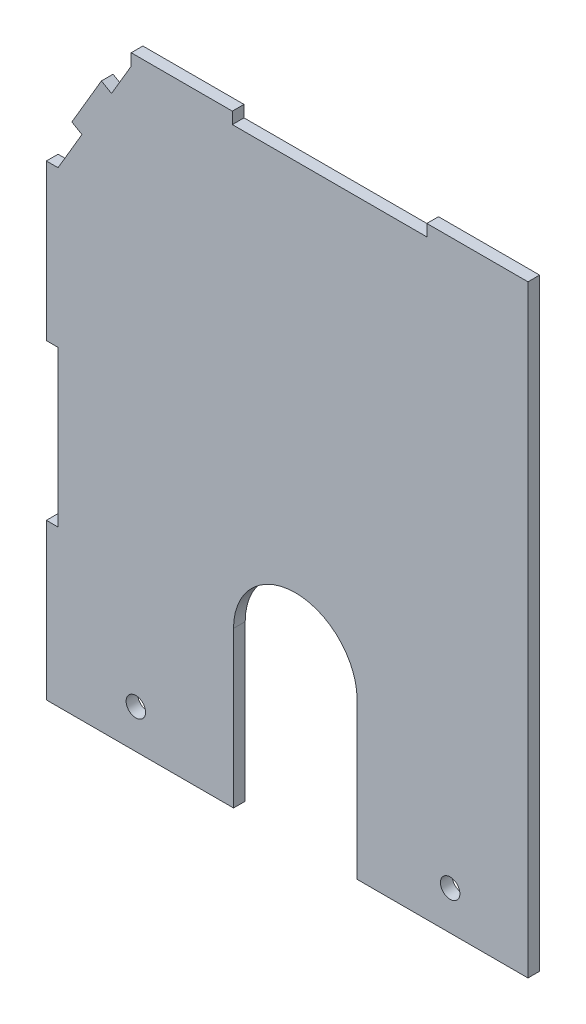
ISO-10303-21;
HEADER;
FILE_DESCRIPTION(('STEP AP214'),'2;1');
FILE_NAME('part.step','',(''),(''),'','','');
FILE_SCHEMA(('AUTOMOTIVE_DESIGN { 1 0 10303 214 1 1 1 1 }'));
ENDSEC;
DATA;
#1=APPLICATION_CONTEXT('core data for automotive mechanical design processes');
#2=APPLICATION_PROTOCOL_DEFINITION('international standard','automotive_design',2000,#1);
#3=PRODUCT_CONTEXT('',#1,'mechanical');
#4=PRODUCT('Part','Part','',(#3));
#5=PRODUCT_RELATED_PRODUCT_CATEGORY('part','',(#4));
#6=PRODUCT_DEFINITION_FORMATION('','',#4);
#7=PRODUCT_DEFINITION_CONTEXT('part definition',#1,'design');
#8=PRODUCT_DEFINITION('design','',#6,#7);
#9=PRODUCT_DEFINITION_SHAPE('','',#8);
#10=(LENGTH_UNIT() NAMED_UNIT(*) SI_UNIT(.MILLI.,.METRE.));
#11=(NAMED_UNIT(*) PLANE_ANGLE_UNIT() SI_UNIT($,.RADIAN.));
#12=(NAMED_UNIT(*) SI_UNIT($,.STERADIAN.) SOLID_ANGLE_UNIT());
#13=UNCERTAINTY_MEASURE_WITH_UNIT(LENGTH_MEASURE(1.E-05),#10,'distance_accuracy_value','');
#14=(GEOMETRIC_REPRESENTATION_CONTEXT(3) GLOBAL_UNCERTAINTY_ASSIGNED_CONTEXT((#13)) GLOBAL_UNIT_ASSIGNED_CONTEXT((#10,
#11,#12)) REPRESENTATION_CONTEXT('',''));
#15=CARTESIAN_POINT('',(0.,0.,0.));
#16=DIRECTION('',(0.,0.,1.));
#17=DIRECTION('',(1.,0.,0.));
#18=AXIS2_PLACEMENT_3D('',#15,#16,#17);
#19=CARTESIAN_POINT('',(0.56000000000009,-36.0440360897276,3.));
#20=DIRECTION('',(0.,0.,1.));
#21=DIRECTION('',(1.,0.,0.));
#22=AXIS2_PLACEMENT_3D('',#19,#20,#21);
#23=PLANE('',#22);
#24=CARTESIAN_POINT('',(-40.4399999999999,-66.0440360897276,3.));
#25=DIRECTION('',(0.,0.,1.));
#26=DIRECTION('',(1.,0.,0.));
#27=AXIS2_PLACEMENT_3D('',#24,#25,#26);
#28=CIRCLE('',#27,2.5);
#29=CARTESIAN_POINT('',(-37.9399999999999,-66.0440360897276,3.));
#30=VERTEX_POINT('',#29);
#31=EDGE_CURVE('E226',#30,#30,#28,.T.);
#32=ORIENTED_EDGE('',*,*,#31,.F.);
#33=EDGE_LOOP('',(#32));
#34=FACE_BOUND('',#33,.T.);
#35=DIRECTION('',(1.,0.,0.));
#36=VECTOR('',#35,1.);
#37=CARTESIAN_POINT('',(-60.4399999999999,-76.0440360897276,3.));
#38=LINE('',#37,#36);
#39=CARTESIAN_POINT('',(-63.4399999999999,-76.0440360897276,3.));
#40=VERTEX_POINT('',#39);
#41=CARTESIAN_POINT('',(-15.3243473367714,-76.0440360897276,3.));
#42=VERTEX_POINT('',#41);
#43=EDGE_CURVE('E141',#40,#42,#38,.T.);
#44=ORIENTED_EDGE('',*,*,#43,.T.);
#45=DIRECTION('',(0.,1.,0.));
#46=VECTOR('',#45,1.);
#47=CARTESIAN_POINT('',(-15.3243473367714,-36.0440360897276,3.));
#48=LINE('',#47,#46);
#49=CARTESIAN_POINT('',(-15.3243473367714,-36.0440360897276,3.));
#50=VERTEX_POINT('',#49);
#51=EDGE_CURVE('E392',#42,#50,#48,.T.);
#52=ORIENTED_EDGE('',*,*,#51,.T.);
#53=CARTESIAN_POINT('',(0.56000000000009,-36.0440360897276,3.));
#54=DIRECTION('',(0.,0.,-1.));
#55=DIRECTION('',(1.,0.,0.));
#56=AXIS2_PLACEMENT_3D('',#53,#54,#55);
#57=CIRCLE('',#56,15.8843473367715);
#58=CARTESIAN_POINT('',(16.4443473367716,-36.0440360897276,3.));
#59=VERTEX_POINT('',#58);
#60=EDGE_CURVE('E330',#50,#59,#57,.T.);
#61=ORIENTED_EDGE('',*,*,#60,.T.);
#62=DIRECTION('',(0.,-1.,0.));
#63=VECTOR('',#62,1.);
#64=CARTESIAN_POINT('',(16.4443473367716,-36.0440360897276,3.));
#65=LINE('',#64,#63);
#66=CARTESIAN_POINT('',(16.4443473367716,-76.0440360897275,3.));
#67=VERTEX_POINT('',#66);
#68=EDGE_CURVE('E348',#59,#67,#65,.T.);
#69=ORIENTED_EDGE('',*,*,#68,.T.);
#70=DIRECTION('',(1.,0.,0.));
#71=VECTOR('',#70,1.);
#72=CARTESIAN_POINT('',(60.3700000000001,-76.0440360897275,3.));
#73=LINE('',#72,#71);
#74=CARTESIAN_POINT('',(60.3700000000001,-76.0440360897275,3.));
#75=VERTEX_POINT('',#74);
#76=EDGE_CURVE('E345',#67,#75,#73,.T.);
#77=ORIENTED_EDGE('',*,*,#76,.T.);
#78=DIRECTION('',(0.,1.,0.));
#79=VECTOR('',#78,1.);
#80=CARTESIAN_POINT('',(60.3700000000001,75.9559639102725,3.));
#81=LINE('',#80,#79);
#82=CARTESIAN_POINT('',(60.3700000000001,78.9559639102725,3.));
#83=VERTEX_POINT('',#82);
#84=EDGE_CURVE('E347',#75,#83,#81,.T.);
#85=ORIENTED_EDGE('',*,*,#84,.T.);
#86=DIRECTION('',(-1.,0.,0.));
#87=VECTOR('',#86,1.);
#88=CARTESIAN_POINT('',(60.3700000000001,78.9559639102725,3.));
#89=LINE('',#88,#87);
#90=CARTESIAN_POINT('',(34.3700000000001,78.9559639102725,3.));
#91=VERTEX_POINT('',#90);
#92=EDGE_CURVE('E350',#83,#91,#89,.T.);
#93=ORIENTED_EDGE('',*,*,#92,.T.);
#94=DIRECTION('',(0.,-1.,0.));
#95=VECTOR('',#94,1.);
#96=CARTESIAN_POINT('',(34.3700000000001,78.9559639102725,3.));
#97=LINE('',#96,#95);
#98=CARTESIAN_POINT('',(34.3700000000001,75.9559639102724,3.));
#99=VERTEX_POINT('',#98);
#100=EDGE_CURVE('E356',#91,#99,#97,.T.);
#101=ORIENTED_EDGE('',*,*,#100,.T.);
#102=DIRECTION('',(-1.,0.,0.));
#103=VECTOR('',#102,1.);
#104=CARTESIAN_POINT('',(34.3700000000001,75.9559639102724,3.));
#105=LINE('',#104,#103);
#106=CARTESIAN_POINT('',(-15.6299999999999,75.9559639102725,3.));
#107=VERTEX_POINT('',#106);
#108=EDGE_CURVE('E358',#99,#107,#105,.T.);
#109=ORIENTED_EDGE('',*,*,#108,.T.);
#110=DIRECTION('',(0.,1.,0.));
#111=VECTOR('',#110,1.);
#112=CARTESIAN_POINT('',(-15.6299999999999,78.9559639102725,3.));
#113=LINE('',#112,#111);
#114=CARTESIAN_POINT('',(-15.6299999999999,78.9559639102725,3.));
#115=VERTEX_POINT('',#114);
#116=EDGE_CURVE('E360',#107,#115,#113,.T.);
#117=ORIENTED_EDGE('',*,*,#116,.T.);
#118=DIRECTION('',(-1.,0.,0.));
#119=VECTOR('',#118,1.);
#120=CARTESIAN_POINT('',(-41.6299999999999,78.9559639102725,3.));
#121=LINE('',#120,#119);
#122=CARTESIAN_POINT('',(-41.6299999999999,78.9559639102725,3.));
#123=VERTEX_POINT('',#122);
#124=EDGE_CURVE('E362',#115,#123,#121,.T.);
#125=ORIENTED_EDGE('',*,*,#124,.T.);
#126=DIRECTION('',(0.,-1.,0.));
#127=VECTOR('',#126,1.);
#128=CARTESIAN_POINT('',(-41.6299999999999,75.9559639102724,3.));
#129=LINE('',#128,#127);
#130=CARTESIAN_POINT('',(-41.6299999999999,75.9559639102724,3.));
#131=VERTEX_POINT('',#130);
#132=EDGE_CURVE('E364',#123,#131,#129,.T.);
#133=ORIENTED_EDGE('',*,*,#132,.T.);
#134=DIRECTION('',(-0.506749312224092,-0.862093460455657,0.));
#135=VECTOR('',#134,1.);
#136=CARTESIAN_POINT('',(-41.6299999999999,75.9559639102724,3.));
#137=LINE('',#136,#135);
#138=CARTESIAN_POINT('',(-46.6974931222408,67.3350293057159,3.));
#139=VERTEX_POINT('',#138);
#140=EDGE_CURVE('E366',#131,#139,#137,.T.);
#141=ORIENTED_EDGE('',*,*,#140,.T.);
#142=DIRECTION('',(-0.862093460455656,0.506749312224094,0.));
#143=VECTOR('',#142,1.);
#144=CARTESIAN_POINT('',(-46.6974931222408,67.3350293057159,3.));
#145=LINE('',#144,#143);
#146=CARTESIAN_POINT('',(-49.2837735036078,68.8552772423882,3.));
#147=VERTEX_POINT('',#146);
#148=EDGE_CURVE('E368',#139,#147,#145,.T.);
#149=ORIENTED_EDGE('',*,*,#148,.T.);
#150=DIRECTION('',(-0.506749312224091,-0.862093460455658,0.));
#151=VECTOR('',#150,1.);
#152=CARTESIAN_POINT('',(-56.8850131869692,55.9238753355533,3.));
#153=LINE('',#152,#151);
#154=CARTESIAN_POINT('',(-56.8850131869692,55.9238753355533,3.));
#155=VERTEX_POINT('',#154);
#156=EDGE_CURVE('E370',#147,#155,#153,.T.);
#157=ORIENTED_EDGE('',*,*,#156,.T.);
#158=DIRECTION('',(0.862093460455658,-0.50674931222409,0.));
#159=VECTOR('',#158,1.);
#160=CARTESIAN_POINT('',(-54.2987328056022,54.403627398881,3.));
#161=LINE('',#160,#159);
#162=CARTESIAN_POINT('',(-54.2987328056022,54.403627398881,3.));
#163=VERTEX_POINT('',#162);
#164=EDGE_CURVE('E372',#155,#163,#161,.T.);
#165=ORIENTED_EDGE('',*,*,#164,.T.);
#166=DIRECTION('',(-0.506749312224092,-0.862093460455657,0.));
#167=VECTOR('',#166,1.);
#168=CARTESIAN_POINT('',(-54.2987328056022,54.403627398881,3.));
#169=LINE('',#168,#167);
#170=CARTESIAN_POINT('',(-60.4399999999999,43.9559639102724,3.));
#171=VERTEX_POINT('',#170);
#172=EDGE_CURVE('E374',#163,#171,#169,.T.);
#173=ORIENTED_EDGE('',*,*,#172,.T.);
#174=DIRECTION('',(-1.,0.,0.));
#175=VECTOR('',#174,1.);
#176=CARTESIAN_POINT('',(-60.4399999999999,43.9559639102724,3.));
#177=LINE('',#176,#175);
#178=CARTESIAN_POINT('',(-63.4399999999999,43.9559639102724,3.));
#179=VERTEX_POINT('',#178);
#180=EDGE_CURVE('E376',#171,#179,#177,.T.);
#181=ORIENTED_EDGE('',*,*,#180,.T.);
#182=DIRECTION('',(0.,-1.,0.));
#183=VECTOR('',#182,1.);
#184=CARTESIAN_POINT('',(-63.4399999999999,43.9559639102724,3.));
#185=LINE('',#184,#183);
#186=CARTESIAN_POINT('',(-63.4399999999999,3.95596391027241,3.));
#187=VERTEX_POINT('',#186);
#188=EDGE_CURVE('E378',#179,#187,#185,.T.);
#189=ORIENTED_EDGE('',*,*,#188,.T.);
#190=DIRECTION('',(1.,0.,0.));
#191=VECTOR('',#190,1.);
#192=CARTESIAN_POINT('',(-63.4399999999999,3.95596391027241,3.));
#193=LINE('',#192,#191);
#194=CARTESIAN_POINT('',(-60.4399999999999,3.95596391027241,3.));
#195=VERTEX_POINT('',#194);
#196=EDGE_CURVE('E206',#187,#195,#193,.T.);
#197=ORIENTED_EDGE('',*,*,#196,.T.);
#198=DIRECTION('',(0.,-1.,0.));
#199=VECTOR('',#198,1.);
#200=CARTESIAN_POINT('',(-60.4399999999999,3.95596391027241,3.));
#201=LINE('',#200,#199);
#202=CARTESIAN_POINT('',(-60.4399999999999,-36.0440360897276,3.));
#203=VERTEX_POINT('',#202);
#204=EDGE_CURVE('E200',#195,#203,#201,.T.);
#205=ORIENTED_EDGE('',*,*,#204,.T.);
#206=DIRECTION('',(-1.,0.,0.));
#207=VECTOR('',#206,1.);
#208=CARTESIAN_POINT('',(-63.4399999999999,-36.0440360897276,3.));
#209=LINE('',#208,#207);
#210=CARTESIAN_POINT('',(-63.4399999999999,-36.0440360897276,3.));
#211=VERTEX_POINT('',#210);
#212=EDGE_CURVE('E204',#203,#211,#209,.T.);
#213=ORIENTED_EDGE('',*,*,#212,.T.);
#214=DIRECTION('',(0.,-1.,0.));
#215=VECTOR('',#214,1.);
#216=CARTESIAN_POINT('',(-63.4399999999999,-76.0440360897276,3.));
#217=LINE('',#216,#215);
#218=EDGE_CURVE('E54',#211,#40,#217,.T.);
#219=ORIENTED_EDGE('',*,*,#218,.T.);
#220=EDGE_LOOP('',(#44,#52,#61,#69,#77,#85,#93,#101,#109,#117,#125,#133,#141,#149,#157,#165,
#173,#181,#189,#197,#205,#213,#219));
#221=FACE_BOUND('',#220,.T.);
#222=CARTESIAN_POINT('',(40.3700000000001,-66.0440360897276,3.));
#223=DIRECTION('',(0.,0.,1.));
#224=DIRECTION('',(1.,0.,0.));
#225=AXIS2_PLACEMENT_3D('',#222,#223,#224);
#226=CIRCLE('',#225,2.5);
#227=CARTESIAN_POINT('',(42.8700000000001,-66.0440360897276,3.));
#228=VERTEX_POINT('',#227);
#229=EDGE_CURVE('E660',#228,#228,#226,.T.);
#230=ORIENTED_EDGE('',*,*,#229,.F.);
#231=EDGE_LOOP('',(#230));
#232=FACE_BOUND('',#231,.T.);
#233=ADVANCED_FACE('F37',(#34,#221,#232),#23,.T.);
#234=CARTESIAN_POINT('',(0.56000000000009,-36.0440360897276,0.));
#235=DIRECTION('',(0.,0.,1.));
#236=DIRECTION('',(1.,0.,0.));
#237=AXIS2_PLACEMENT_3D('',#234,#235,#236);
#238=PLANE('',#237);
#239=DIRECTION('',(1.,0.,0.));
#240=VECTOR('',#239,1.);
#241=CARTESIAN_POINT('',(-15.3243473367714,-76.0440360897276,0.));
#242=LINE('',#241,#240);
#243=CARTESIAN_POINT('',(-63.4399999999999,-76.0440360897276,0.));
#244=VERTEX_POINT('',#243);
#245=CARTESIAN_POINT('',(-15.3243473367714,-76.0440360897276,0.));
#246=VERTEX_POINT('',#245);
#247=EDGE_CURVE('E135',#244,#246,#242,.T.);
#248=ORIENTED_EDGE('',*,*,#247,.F.);
#249=DIRECTION('',(0.,-1.,0.));
#250=VECTOR('',#249,1.);
#251=CARTESIAN_POINT('',(-63.4399999999999,-76.0440360897276,0.));
#252=LINE('',#251,#250);
#253=CARTESIAN_POINT('',(-63.4399999999999,-36.0440360897276,0.));
#254=VERTEX_POINT('',#253);
#255=EDGE_CURVE('E267',#254,#244,#252,.T.);
#256=ORIENTED_EDGE('',*,*,#255,.F.);
#257=DIRECTION('',(-1.,0.,0.));
#258=VECTOR('',#257,1.);
#259=CARTESIAN_POINT('',(-63.4399999999999,-36.0440360897276,0.));
#260=LINE('',#259,#258);
#261=CARTESIAN_POINT('',(-60.4399999999999,-36.0440360897276,0.));
#262=VERTEX_POINT('',#261);
#263=EDGE_CURVE('E128',#262,#254,#260,.T.);
#264=ORIENTED_EDGE('',*,*,#263,.F.);
#265=DIRECTION('',(0.,-1.,0.));
#266=VECTOR('',#265,1.);
#267=CARTESIAN_POINT('',(-60.4399999999999,3.95596391027241,0.));
#268=LINE('',#267,#266);
#269=CARTESIAN_POINT('',(-60.4399999999999,3.95596391027241,0.));
#270=VERTEX_POINT('',#269);
#271=EDGE_CURVE('E214',#270,#262,#268,.T.);
#272=ORIENTED_EDGE('',*,*,#271,.F.);
#273=DIRECTION('',(1.,0.,0.));
#274=VECTOR('',#273,1.);
#275=CARTESIAN_POINT('',(-63.4399999999999,3.95596391027241,0.));
#276=LINE('',#275,#274);
#277=CARTESIAN_POINT('',(-63.4399999999999,3.95596391027241,0.));
#278=VERTEX_POINT('',#277);
#279=EDGE_CURVE('E263',#278,#270,#276,.T.);
#280=ORIENTED_EDGE('',*,*,#279,.F.);
#281=DIRECTION('',(0.,-1.,0.));
#282=VECTOR('',#281,1.);
#283=CARTESIAN_POINT('',(-63.4399999999999,43.9559639102724,0.));
#284=LINE('',#283,#282);
#285=CARTESIAN_POINT('',(-63.4399999999999,43.9559639102724,0.));
#286=VERTEX_POINT('',#285);
#287=EDGE_CURVE('E261',#286,#278,#284,.T.);
#288=ORIENTED_EDGE('',*,*,#287,.F.);
#289=DIRECTION('',(-1.,0.,0.));
#290=VECTOR('',#289,1.);
#291=CARTESIAN_POINT('',(-60.4399999999999,43.9559639102724,0.));
#292=LINE('',#291,#290);
#293=CARTESIAN_POINT('',(-60.4399999999999,43.9559639102724,0.));
#294=VERTEX_POINT('',#293);
#295=EDGE_CURVE('E259',#294,#286,#292,.T.);
#296=ORIENTED_EDGE('',*,*,#295,.F.);
#297=DIRECTION('',(-0.506749312224092,-0.862093460455657,0.));
#298=VECTOR('',#297,1.);
#299=CARTESIAN_POINT('',(-54.2987328056022,54.403627398881,0.));
#300=LINE('',#299,#298);
#301=CARTESIAN_POINT('',(-54.2987328056022,54.403627398881,0.));
#302=VERTEX_POINT('',#301);
#303=EDGE_CURVE('E257',#302,#294,#300,.T.);
#304=ORIENTED_EDGE('',*,*,#303,.F.);
#305=DIRECTION('',(0.862093460455658,-0.50674931222409,0.));
#306=VECTOR('',#305,1.);
#307=CARTESIAN_POINT('',(-54.2987328056022,54.403627398881,0.));
#308=LINE('',#307,#306);
#309=CARTESIAN_POINT('',(-56.8850131869692,55.9238753355533,0.));
#310=VERTEX_POINT('',#309);
#311=EDGE_CURVE('E255',#310,#302,#308,.T.);
#312=ORIENTED_EDGE('',*,*,#311,.F.);
#313=DIRECTION('',(-0.506749312224091,-0.862093460455658,0.));
#314=VECTOR('',#313,1.);
#315=CARTESIAN_POINT('',(-56.8850131869692,55.9238753355533,0.));
#316=LINE('',#315,#314);
#317=CARTESIAN_POINT('',(-49.2837735036078,68.8552772423882,0.));
#318=VERTEX_POINT('',#317);
#319=EDGE_CURVE('E253',#318,#310,#316,.T.);
#320=ORIENTED_EDGE('',*,*,#319,.F.);
#321=DIRECTION('',(-0.862093460455656,0.506749312224094,0.));
#322=VECTOR('',#321,1.);
#323=CARTESIAN_POINT('',(-46.6974931222408,67.3350293057159,0.));
#324=LINE('',#323,#322);
#325=CARTESIAN_POINT('',(-46.6974931222408,67.3350293057159,0.));
#326=VERTEX_POINT('',#325);
#327=EDGE_CURVE('E251',#326,#318,#324,.T.);
#328=ORIENTED_EDGE('',*,*,#327,.F.);
#329=DIRECTION('',(-0.506749312224092,-0.862093460455657,0.));
#330=VECTOR('',#329,1.);
#331=CARTESIAN_POINT('',(-41.6299999999999,75.9559639102724,0.));
#332=LINE('',#331,#330);
#333=CARTESIAN_POINT('',(-41.6299999999999,75.9559639102724,0.));
#334=VERTEX_POINT('',#333);
#335=EDGE_CURVE('E249',#334,#326,#332,.T.);
#336=ORIENTED_EDGE('',*,*,#335,.F.);
#337=DIRECTION('',(0.,-1.,0.));
#338=VECTOR('',#337,1.);
#339=CARTESIAN_POINT('',(-41.6299999999999,75.9559639102724,0.));
#340=LINE('',#339,#338);
#341=CARTESIAN_POINT('',(-41.6299999999999,78.9559639102725,0.));
#342=VERTEX_POINT('',#341);
#343=EDGE_CURVE('E247',#342,#334,#340,.T.);
#344=ORIENTED_EDGE('',*,*,#343,.F.);
#345=DIRECTION('',(-1.,0.,0.));
#346=VECTOR('',#345,1.);
#347=CARTESIAN_POINT('',(-41.6299999999999,78.9559639102725,0.));
#348=LINE('',#347,#346);
#349=CARTESIAN_POINT('',(-15.6299999999999,78.9559639102725,0.));
#350=VERTEX_POINT('',#349);
#351=EDGE_CURVE('E245',#350,#342,#348,.T.);
#352=ORIENTED_EDGE('',*,*,#351,.F.);
#353=DIRECTION('',(0.,1.,0.));
#354=VECTOR('',#353,1.);
#355=CARTESIAN_POINT('',(-15.6299999999999,78.9559639102725,0.));
#356=LINE('',#355,#354);
#357=CARTESIAN_POINT('',(-15.6299999999999,75.9559639102725,0.));
#358=VERTEX_POINT('',#357);
#359=EDGE_CURVE('E243',#358,#350,#356,.T.);
#360=ORIENTED_EDGE('',*,*,#359,.F.);
#361=DIRECTION('',(-1.,0.,0.));
#362=VECTOR('',#361,1.);
#363=CARTESIAN_POINT('',(34.3700000000001,75.9559639102724,0.));
#364=LINE('',#363,#362);
#365=CARTESIAN_POINT('',(34.3700000000001,75.9559639102724,0.));
#366=VERTEX_POINT('',#365);
#367=EDGE_CURVE('E241',#366,#358,#364,.T.);
#368=ORIENTED_EDGE('',*,*,#367,.F.);
#369=DIRECTION('',(0.,-1.,0.));
#370=VECTOR('',#369,1.);
#371=CARTESIAN_POINT('',(34.3700000000001,78.9559639102725,0.));
#372=LINE('',#371,#370);
#373=CARTESIAN_POINT('',(34.3700000000001,78.9559639102725,0.));
#374=VERTEX_POINT('',#373);
#375=EDGE_CURVE('E239',#374,#366,#372,.T.);
#376=ORIENTED_EDGE('',*,*,#375,.F.);
#377=DIRECTION('',(-1.,0.,0.));
#378=VECTOR('',#377,1.);
#379=CARTESIAN_POINT('',(60.3700000000001,78.9559639102725,0.));
#380=LINE('',#379,#378);
#381=CARTESIAN_POINT('',(60.3700000000001,78.9559639102725,0.));
#382=VERTEX_POINT('',#381);
#383=EDGE_CURVE('E237',#382,#374,#380,.T.);
#384=ORIENTED_EDGE('',*,*,#383,.F.);
#385=DIRECTION('',(0.,1.,0.));
#386=VECTOR('',#385,1.);
#387=CARTESIAN_POINT('',(60.3700000000001,75.9559639102725,0.));
#388=LINE('',#387,#386);
#389=CARTESIAN_POINT('',(60.3700000000001,-76.0440360897275,0.));
#390=VERTEX_POINT('',#389);
#391=EDGE_CURVE('E235',#390,#382,#388,.T.);
#392=ORIENTED_EDGE('',*,*,#391,.F.);
#393=DIRECTION('',(1.,0.,0.));
#394=VECTOR('',#393,1.);
#395=CARTESIAN_POINT('',(60.3700000000001,-76.0440360897275,0.));
#396=LINE('',#395,#394);
#397=CARTESIAN_POINT('',(16.4443473367716,-76.0440360897275,0.));
#398=VERTEX_POINT('',#397);
#399=EDGE_CURVE('E232',#398,#390,#396,.T.);
#400=ORIENTED_EDGE('',*,*,#399,.F.);
#401=DIRECTION('',(0.,-1.,0.));
#402=VECTOR('',#401,1.);
#403=CARTESIAN_POINT('',(16.4443473367716,-36.0440360897276,0.));
#404=LINE('',#403,#402);
#405=CARTESIAN_POINT('',(16.4443473367716,-36.0440360897276,0.));
#406=VERTEX_POINT('',#405);
#407=EDGE_CURVE('E230',#406,#398,#404,.T.);
#408=ORIENTED_EDGE('',*,*,#407,.F.);
#409=CARTESIAN_POINT('',(0.56000000000009,-36.0440360897276,0.));
#410=DIRECTION('',(0.,0.,-1.));
#411=DIRECTION('',(1.,0.,0.));
#412=AXIS2_PLACEMENT_3D('',#409,#410,#411);
#413=CIRCLE('',#412,15.8843473367715);
#414=CARTESIAN_POINT('',(-15.3243473367714,-36.0440360897276,0.));
#415=VERTEX_POINT('',#414);
#416=EDGE_CURVE('E228',#415,#406,#413,.T.);
#417=ORIENTED_EDGE('',*,*,#416,.F.);
#418=DIRECTION('',(0.,1.,0.));
#419=VECTOR('',#418,1.);
#420=CARTESIAN_POINT('',(-15.3243473367714,-36.0440360897276,0.));
#421=LINE('',#420,#419);
#422=EDGE_CURVE('E225',#246,#415,#421,.T.);
#423=ORIENTED_EDGE('',*,*,#422,.F.);
#424=EDGE_LOOP('',(#248,#256,#264,#272,#280,#288,#296,#304,#312,#320,#328,#336,#344,#352,#360,
#368,#376,#384,#392,#400,#408,#417,#423));
#425=FACE_BOUND('',#424,.T.);
#426=CARTESIAN_POINT('',(-40.4399999999999,-66.0440360897276,0.));
#427=DIRECTION('',(0.,0.,1.));
#428=DIRECTION('',(1.,0.,0.));
#429=AXIS2_PLACEMENT_3D('',#426,#427,#428);
#430=CIRCLE('',#429,2.5);
#431=CARTESIAN_POINT('',(-37.9399999999999,-66.0440360897276,0.));
#432=VERTEX_POINT('',#431);
#433=EDGE_CURVE('E396',#432,#432,#430,.T.);
#434=ORIENTED_EDGE('',*,*,#433,.T.);
#435=EDGE_LOOP('',(#434));
#436=FACE_BOUND('',#435,.T.);
#437=CARTESIAN_POINT('',(40.3700000000001,-66.0440360897276,0.));
#438=DIRECTION('',(0.,0.,1.));
#439=DIRECTION('',(1.,0.,0.));
#440=AXIS2_PLACEMENT_3D('',#437,#438,#439);
#441=CIRCLE('',#440,2.5);
#442=CARTESIAN_POINT('',(42.8700000000001,-66.0440360897276,0.));
#443=VERTEX_POINT('',#442);
#444=EDGE_CURVE('E663',#443,#443,#441,.T.);
#445=ORIENTED_EDGE('',*,*,#444,.T.);
#446=EDGE_LOOP('',(#445));
#447=FACE_BOUND('',#446,.T.);
#448=ADVANCED_FACE('F334',(#425,#436,#447),#238,.F.);
#449=CARTESIAN_POINT('',(-15.3243473367714,-76.0440360897276,3.));
#450=DIRECTION('',(0.,1.,0.));
#451=DIRECTION('',(0.,0.,1.));
#452=AXIS2_PLACEMENT_3D('',#449,#450,#451);
#453=PLANE('',#452);
#454=ORIENTED_EDGE('',*,*,#247,.T.);
#455=DIRECTION('',(0.,0.,-1.));
#456=VECTOR('',#455,1.);
#457=CARTESIAN_POINT('',(-15.3243473367714,-76.0440360897276,3.));
#458=LINE('',#457,#456);
#459=EDGE_CURVE('E11',#42,#246,#458,.T.);
#460=ORIENTED_EDGE('',*,*,#459,.F.);
#461=ORIENTED_EDGE('',*,*,#43,.F.);
#462=DIRECTION('',(0.,0.,-1.));
#463=VECTOR('',#462,1.);
#464=CARTESIAN_POINT('',(-63.4399999999999,-76.0440360897276,3.));
#465=LINE('',#464,#463);
#466=EDGE_CURVE('E220',#40,#244,#465,.T.);
#467=ORIENTED_EDGE('',*,*,#466,.T.);
#468=EDGE_LOOP('',(#454,#460,#461,#467));
#469=FACE_BOUND('',#468,.T.);
#470=ADVANCED_FACE('F39',(#469),#453,.F.);
#471=CARTESIAN_POINT('',(-15.3243473367714,-36.0440360897276,3.));
#472=DIRECTION('',(-1.,0.,0.));
#473=DIRECTION('',(0.,-1.,0.));
#474=AXIS2_PLACEMENT_3D('',#471,#472,#473);
#475=PLANE('',#474);
#476=ORIENTED_EDGE('',*,*,#422,.T.);
#477=DIRECTION('',(0.,0.,-1.));
#478=VECTOR('',#477,1.);
#479=CARTESIAN_POINT('',(-15.3243473367714,-36.0440360897276,3.));
#480=LINE('',#479,#478);
#481=EDGE_CURVE('E46',#50,#415,#480,.T.);
#482=ORIENTED_EDGE('',*,*,#481,.F.);
#483=ORIENTED_EDGE('',*,*,#51,.F.);
#484=ORIENTED_EDGE('',*,*,#459,.T.);
#485=EDGE_LOOP('',(#476,#482,#483,#484));
#486=FACE_BOUND('',#485,.T.);
#487=ADVANCED_FACE('F398',(#486),#475,.F.);
#488=CARTESIAN_POINT('',(0.56000000000009,-36.0440360897276,3.));
#489=DIRECTION('',(0.,0.,-1.));
#490=DIRECTION('',(-1.,0.,0.));
#491=AXIS2_PLACEMENT_3D('',#488,#489,#490);
#492=CYLINDRICAL_SURFACE('',#491,15.8843473367715);
#493=ORIENTED_EDGE('',*,*,#416,.T.);
#494=DIRECTION('',(0.,0.,-1.));
#495=VECTOR('',#494,1.);
#496=CARTESIAN_POINT('',(16.4443473367716,-36.0440360897276,3.));
#497=LINE('',#496,#495);
#498=EDGE_CURVE('E321',#59,#406,#497,.T.);
#499=ORIENTED_EDGE('',*,*,#498,.F.);
#500=ORIENTED_EDGE('',*,*,#60,.F.);
#501=ORIENTED_EDGE('',*,*,#481,.T.);
#502=EDGE_LOOP('',(#493,#499,#500,#501));
#503=FACE_BOUND('',#502,.T.);
#504=ADVANCED_FACE('F328',(#503),#492,.F.);
#505=CARTESIAN_POINT('',(16.4443473367716,-36.0440360897276,3.));
#506=DIRECTION('',(1.,0.,0.));
#507=DIRECTION('',(0.,0.,-1.));
#508=AXIS2_PLACEMENT_3D('',#505,#506,#507);
#509=PLANE('',#508);
#510=ORIENTED_EDGE('',*,*,#407,.T.);
#511=DIRECTION('',(0.,0.,-1.));
#512=VECTOR('',#511,1.);
#513=CARTESIAN_POINT('',(16.4443473367716,-76.0440360897275,3.));
#514=LINE('',#513,#512);
#515=EDGE_CURVE('E318',#67,#398,#514,.T.);
#516=ORIENTED_EDGE('',*,*,#515,.F.);
#517=ORIENTED_EDGE('',*,*,#68,.F.);
#518=ORIENTED_EDGE('',*,*,#498,.T.);
#519=EDGE_LOOP('',(#510,#516,#517,#518));
#520=FACE_BOUND('',#519,.T.);
#521=ADVANCED_FACE('F339',(#520),#509,.F.);
#522=CARTESIAN_POINT('',(60.3700000000001,-76.0440360897275,3.));
#523=DIRECTION('',(0.,1.,0.));
#524=DIRECTION('',(0.,0.,1.));
#525=AXIS2_PLACEMENT_3D('',#522,#523,#524);
#526=PLANE('',#525);
#527=ORIENTED_EDGE('',*,*,#399,.T.);
#528=DIRECTION('',(0.,0.,-1.));
#529=VECTOR('',#528,1.);
#530=CARTESIAN_POINT('',(60.3700000000001,-76.0440360897275,3.));
#531=LINE('',#530,#529);
#532=EDGE_CURVE('E315',#75,#390,#531,.T.);
#533=ORIENTED_EDGE('',*,*,#532,.F.);
#534=ORIENTED_EDGE('',*,*,#76,.F.);
#535=ORIENTED_EDGE('',*,*,#515,.T.);
#536=EDGE_LOOP('',(#527,#533,#534,#535));
#537=FACE_BOUND('',#536,.T.);
#538=ADVANCED_FACE('F343',(#537),#526,.F.);
#539=CARTESIAN_POINT('',(60.3700000000001,75.9559639102725,3.));
#540=DIRECTION('',(-1.,0.,0.));
#541=DIRECTION('',(0.,0.,1.));
#542=AXIS2_PLACEMENT_3D('',#539,#540,#541);
#543=PLANE('',#542);
#544=ORIENTED_EDGE('',*,*,#391,.T.);
#545=DIRECTION('',(0.,0.,-1.));
#546=VECTOR('',#545,1.);
#547=CARTESIAN_POINT('',(60.3700000000001,78.9559639102725,3.));
#548=LINE('',#547,#546);
#549=EDGE_CURVE('E312',#83,#382,#548,.T.);
#550=ORIENTED_EDGE('',*,*,#549,.F.);
#551=ORIENTED_EDGE('',*,*,#84,.F.);
#552=ORIENTED_EDGE('',*,*,#532,.T.);
#553=EDGE_LOOP('',(#544,#550,#551,#552));
#554=FACE_BOUND('',#553,.T.);
#555=ADVANCED_FACE('F474',(#554),#543,.F.);
#556=CARTESIAN_POINT('',(60.3700000000001,78.9559639102725,3.));
#557=DIRECTION('',(0.,-1.,0.));
#558=DIRECTION('',(0.,0.,-1.));
#559=AXIS2_PLACEMENT_3D('',#556,#557,#558);
#560=PLANE('',#559);
#561=ORIENTED_EDGE('',*,*,#383,.T.);
#562=DIRECTION('',(0.,0.,-1.));
#563=VECTOR('',#562,1.);
#564=CARTESIAN_POINT('',(34.3700000000001,78.9559639102725,3.));
#565=LINE('',#564,#563);
#566=EDGE_CURVE('E309',#91,#374,#565,.T.);
#567=ORIENTED_EDGE('',*,*,#566,.F.);
#568=ORIENTED_EDGE('',*,*,#92,.F.);
#569=ORIENTED_EDGE('',*,*,#549,.T.);
#570=EDGE_LOOP('',(#561,#567,#568,#569));
#571=FACE_BOUND('',#570,.T.);
#572=ADVANCED_FACE('F470',(#571),#560,.F.);
#573=CARTESIAN_POINT('',(34.3700000000001,78.9559639102725,3.));
#574=DIRECTION('',(1.,0.,0.));
#575=DIRECTION('',(0.,1.,0.));
#576=AXIS2_PLACEMENT_3D('',#573,#574,#575);
#577=PLANE('',#576);
#578=ORIENTED_EDGE('',*,*,#375,.T.);
#579=DIRECTION('',(0.,0.,-1.));
#580=VECTOR('',#579,1.);
#581=CARTESIAN_POINT('',(34.3700000000001,75.9559639102724,3.));
#582=LINE('',#581,#580);
#583=EDGE_CURVE('E306',#99,#366,#582,.T.);
#584=ORIENTED_EDGE('',*,*,#583,.F.);
#585=ORIENTED_EDGE('',*,*,#100,.F.);
#586=ORIENTED_EDGE('',*,*,#566,.T.);
#587=EDGE_LOOP('',(#578,#584,#585,#586));
#588=FACE_BOUND('',#587,.T.);
#589=ADVANCED_FACE('F466',(#588),#577,.F.);
#590=CARTESIAN_POINT('',(34.3700000000001,75.9559639102724,3.));
#591=DIRECTION('',(0.,-1.,0.));
#592=DIRECTION('',(1.,0.,0.));
#593=AXIS2_PLACEMENT_3D('',#590,#591,#592);
#594=PLANE('',#593);
#595=ORIENTED_EDGE('',*,*,#367,.T.);
#596=DIRECTION('',(0.,0.,-1.));
#597=VECTOR('',#596,1.);
#598=CARTESIAN_POINT('',(-15.6299999999999,75.9559639102725,3.));
#599=LINE('',#598,#597);
#600=EDGE_CURVE('E303',#107,#358,#599,.T.);
#601=ORIENTED_EDGE('',*,*,#600,.F.);
#602=ORIENTED_EDGE('',*,*,#108,.F.);
#603=ORIENTED_EDGE('',*,*,#583,.T.);
#604=EDGE_LOOP('',(#595,#601,#602,#603));
#605=FACE_BOUND('',#604,.T.);
#606=ADVANCED_FACE('F462',(#605),#594,.F.);
#607=CARTESIAN_POINT('',(-15.6299999999999,78.9559639102725,3.));
#608=DIRECTION('',(-1.,0.,0.));
#609=DIRECTION('',(0.,-1.,0.));
#610=AXIS2_PLACEMENT_3D('',#607,#608,#609);
#611=PLANE('',#610);
#612=ORIENTED_EDGE('',*,*,#359,.T.);
#613=DIRECTION('',(0.,0.,-1.));
#614=VECTOR('',#613,1.);
#615=CARTESIAN_POINT('',(-15.6299999999999,78.9559639102725,3.));
#616=LINE('',#615,#614);
#617=EDGE_CURVE('E300',#115,#350,#616,.T.);
#618=ORIENTED_EDGE('',*,*,#617,.F.);
#619=ORIENTED_EDGE('',*,*,#116,.F.);
#620=ORIENTED_EDGE('',*,*,#600,.T.);
#621=EDGE_LOOP('',(#612,#618,#619,#620));
#622=FACE_BOUND('',#621,.T.);
#623=ADVANCED_FACE('F458',(#622),#611,.F.);
#624=CARTESIAN_POINT('',(-41.6299999999999,78.9559639102725,3.));
#625=DIRECTION('',(0.,-1.,0.));
#626=DIRECTION('',(0.,0.,-1.));
#627=AXIS2_PLACEMENT_3D('',#624,#625,#626);
#628=PLANE('',#627);
#629=ORIENTED_EDGE('',*,*,#351,.T.);
#630=DIRECTION('',(0.,0.,-1.));
#631=VECTOR('',#630,1.);
#632=CARTESIAN_POINT('',(-41.6299999999999,78.9559639102725,3.));
#633=LINE('',#632,#631);
#634=EDGE_CURVE('E297',#123,#342,#633,.T.);
#635=ORIENTED_EDGE('',*,*,#634,.F.);
#636=ORIENTED_EDGE('',*,*,#124,.F.);
#637=ORIENTED_EDGE('',*,*,#617,.T.);
#638=EDGE_LOOP('',(#629,#635,#636,#637));
#639=FACE_BOUND('',#638,.T.);
#640=ADVANCED_FACE('F454',(#639),#628,.F.);
#641=CARTESIAN_POINT('',(-41.6299999999999,75.9559639102724,3.));
#642=DIRECTION('',(1.,0.,0.));
#643=DIRECTION('',(0.,0.,-1.));
#644=AXIS2_PLACEMENT_3D('',#641,#642,#643);
#645=PLANE('',#644);
#646=ORIENTED_EDGE('',*,*,#343,.T.);
#647=DIRECTION('',(0.,0.,-1.));
#648=VECTOR('',#647,1.);
#649=CARTESIAN_POINT('',(-41.6299999999999,75.9559639102724,3.));
#650=LINE('',#649,#648);
#651=EDGE_CURVE('E294',#131,#334,#650,.T.);
#652=ORIENTED_EDGE('',*,*,#651,.F.);
#653=ORIENTED_EDGE('',*,*,#132,.F.);
#654=ORIENTED_EDGE('',*,*,#634,.T.);
#655=EDGE_LOOP('',(#646,#652,#653,#654));
#656=FACE_BOUND('',#655,.T.);
#657=ADVANCED_FACE('F450',(#656),#645,.F.);
#658=CARTESIAN_POINT('',(-41.6299999999999,75.9559639102724,3.));
#659=DIRECTION('',(0.862093460455657,-0.506749312224092,0.));
#660=DIRECTION('',(0.506749312224092,0.862093460455657,0.));
#661=AXIS2_PLACEMENT_3D('',#658,#659,#660);
#662=PLANE('',#661);
#663=ORIENTED_EDGE('',*,*,#335,.T.);
#664=DIRECTION('',(0.,0.,-1.));
#665=VECTOR('',#664,1.);
#666=CARTESIAN_POINT('',(-46.6974931222408,67.3350293057159,3.));
#667=LINE('',#666,#665);
#668=EDGE_CURVE('E291',#139,#326,#667,.T.);
#669=ORIENTED_EDGE('',*,*,#668,.F.);
#670=ORIENTED_EDGE('',*,*,#140,.F.);
#671=ORIENTED_EDGE('',*,*,#651,.T.);
#672=EDGE_LOOP('',(#663,#669,#670,#671));
#673=FACE_BOUND('',#672,.T.);
#674=ADVANCED_FACE('F446',(#673),#662,.F.);
#675=CARTESIAN_POINT('',(-46.6974931222408,67.3350293057159,3.));
#676=DIRECTION('',(-0.506749312224094,-0.862093460455656,0.));
#677=DIRECTION('',(0.862093460455656,-0.506749312224094,0.));
#678=AXIS2_PLACEMENT_3D('',#675,#676,#677);
#679=PLANE('',#678);
#680=ORIENTED_EDGE('',*,*,#327,.T.);
#681=DIRECTION('',(0.,0.,-1.));
#682=VECTOR('',#681,1.);
#683=CARTESIAN_POINT('',(-49.2837735036078,68.8552772423882,3.));
#684=LINE('',#683,#682);
#685=EDGE_CURVE('E288',#147,#318,#684,.T.);
#686=ORIENTED_EDGE('',*,*,#685,.F.);
#687=ORIENTED_EDGE('',*,*,#148,.F.);
#688=ORIENTED_EDGE('',*,*,#668,.T.);
#689=EDGE_LOOP('',(#680,#686,#687,#688));
#690=FACE_BOUND('',#689,.T.);
#691=ADVANCED_FACE('F442',(#690),#679,.F.);
#692=CARTESIAN_POINT('',(-56.8850131869692,55.9238753355533,3.));
#693=DIRECTION('',(0.862093460455657,-0.506749312224091,0.));
#694=DIRECTION('',(0.506749312224091,0.862093460455658,0.));
#695=AXIS2_PLACEMENT_3D('',#692,#693,#694);
#696=PLANE('',#695);
#697=ORIENTED_EDGE('',*,*,#319,.T.);
#698=DIRECTION('',(0.,0.,-1.));
#699=VECTOR('',#698,1.);
#700=CARTESIAN_POINT('',(-56.8850131869692,55.9238753355533,3.));
#701=LINE('',#700,#699);
#702=EDGE_CURVE('E285',#155,#310,#701,.T.);
#703=ORIENTED_EDGE('',*,*,#702,.F.);
#704=ORIENTED_EDGE('',*,*,#156,.F.);
#705=ORIENTED_EDGE('',*,*,#685,.T.);
#706=EDGE_LOOP('',(#697,#703,#704,#705));
#707=FACE_BOUND('',#706,.T.);
#708=ADVANCED_FACE('F438',(#707),#696,.F.);
#709=CARTESIAN_POINT('',(-54.2987328056022,54.403627398881,3.));
#710=DIRECTION('',(0.50674931222409,0.862093460455658,0.));
#711=DIRECTION('',(-0.862093460455659,0.50674931222409,0.));
#712=AXIS2_PLACEMENT_3D('',#709,#710,#711);
#713=PLANE('',#712);
#714=ORIENTED_EDGE('',*,*,#311,.T.);
#715=DIRECTION('',(0.,0.,-1.));
#716=VECTOR('',#715,1.);
#717=CARTESIAN_POINT('',(-54.2987328056022,54.403627398881,3.));
#718=LINE('',#717,#716);
#719=EDGE_CURVE('E282',#163,#302,#718,.T.);
#720=ORIENTED_EDGE('',*,*,#719,.F.);
#721=ORIENTED_EDGE('',*,*,#164,.F.);
#722=ORIENTED_EDGE('',*,*,#702,.T.);
#723=EDGE_LOOP('',(#714,#720,#721,#722));
#724=FACE_BOUND('',#723,.T.);
#725=ADVANCED_FACE('F434',(#724),#713,.F.);
#726=CARTESIAN_POINT('',(-54.2987328056022,54.403627398881,3.));
#727=DIRECTION('',(0.862093460455657,-0.506749312224092,0.));
#728=DIRECTION('',(0.506749312224092,0.862093460455657,0.));
#729=AXIS2_PLACEMENT_3D('',#726,#727,#728);
#730=PLANE('',#729);
#731=ORIENTED_EDGE('',*,*,#303,.T.);
#732=DIRECTION('',(0.,0.,-1.));
#733=VECTOR('',#732,1.);
#734=CARTESIAN_POINT('',(-60.4399999999999,43.9559639102724,3.));
#735=LINE('',#734,#733);
#736=EDGE_CURVE('E279',#171,#294,#735,.T.);
#737=ORIENTED_EDGE('',*,*,#736,.F.);
#738=ORIENTED_EDGE('',*,*,#172,.F.);
#739=ORIENTED_EDGE('',*,*,#719,.T.);
#740=EDGE_LOOP('',(#731,#737,#738,#739));
#741=FACE_BOUND('',#740,.T.);
#742=ADVANCED_FACE('F430',(#741),#730,.F.);
#743=CARTESIAN_POINT('',(-60.4399999999999,43.9559639102724,3.));
#744=DIRECTION('',(0.,-1.,0.));
#745=DIRECTION('',(1.,0.,0.));
#746=AXIS2_PLACEMENT_3D('',#743,#744,#745);
#747=PLANE('',#746);
#748=ORIENTED_EDGE('',*,*,#295,.T.);
#749=DIRECTION('',(0.,0.,-1.));
#750=VECTOR('',#749,1.);
#751=CARTESIAN_POINT('',(-63.4399999999999,43.9559639102724,3.));
#752=LINE('',#751,#750);
#753=EDGE_CURVE('E276',#179,#286,#752,.T.);
#754=ORIENTED_EDGE('',*,*,#753,.F.);
#755=ORIENTED_EDGE('',*,*,#180,.F.);
#756=ORIENTED_EDGE('',*,*,#736,.T.);
#757=EDGE_LOOP('',(#748,#754,#755,#756));
#758=FACE_BOUND('',#757,.T.);
#759=ADVANCED_FACE('F427',(#758),#747,.F.);
#760=CARTESIAN_POINT('',(-63.4399999999999,43.9559639102724,3.));
#761=DIRECTION('',(1.,0.,0.));
#762=DIRECTION('',(0.,0.,-1.));
#763=AXIS2_PLACEMENT_3D('',#760,#761,#762);
#764=PLANE('',#763);
#765=ORIENTED_EDGE('',*,*,#287,.T.);
#766=DIRECTION('',(0.,0.,-1.));
#767=VECTOR('',#766,1.);
#768=CARTESIAN_POINT('',(-63.4399999999999,3.95596391027241,3.));
#769=LINE('',#768,#767);
#770=EDGE_CURVE('E273',#187,#278,#769,.T.);
#771=ORIENTED_EDGE('',*,*,#770,.F.);
#772=ORIENTED_EDGE('',*,*,#188,.F.);
#773=ORIENTED_EDGE('',*,*,#753,.T.);
#774=EDGE_LOOP('',(#765,#771,#772,#773));
#775=FACE_BOUND('',#774,.T.);
#776=ADVANCED_FACE('F384',(#775),#764,.F.);
#777=CARTESIAN_POINT('',(-63.4399999999999,3.95596391027241,3.));
#778=DIRECTION('',(0.,1.,0.));
#779=DIRECTION('',(0.,0.,1.));
#780=AXIS2_PLACEMENT_3D('',#777,#778,#779);
#781=PLANE('',#780);
#782=ORIENTED_EDGE('',*,*,#279,.T.);
#783=DIRECTION('',(0.,0.,-1.));
#784=VECTOR('',#783,1.);
#785=CARTESIAN_POINT('',(-60.4399999999999,3.95596391027241,3.));
#786=LINE('',#785,#784);
#787=EDGE_CURVE('E215',#195,#270,#786,.T.);
#788=ORIENTED_EDGE('',*,*,#787,.F.);
#789=ORIENTED_EDGE('',*,*,#196,.F.);
#790=ORIENTED_EDGE('',*,*,#770,.T.);
#791=EDGE_LOOP('',(#782,#788,#789,#790));
#792=FACE_BOUND('',#791,.T.);
#793=ADVANCED_FACE('F388',(#792),#781,.F.);
#794=CARTESIAN_POINT('',(-60.4399999999999,3.95596391027241,3.));
#795=DIRECTION('',(1.,0.,0.));
#796=DIRECTION('',(0.,0.,-1.));
#797=AXIS2_PLACEMENT_3D('',#794,#795,#796);
#798=PLANE('',#797);
#799=ORIENTED_EDGE('',*,*,#271,.T.);
#800=DIRECTION('',(0.,0.,-1.));
#801=VECTOR('',#800,1.);
#802=CARTESIAN_POINT('',(-60.4399999999999,-36.0440360897276,3.));
#803=LINE('',#802,#801);
#804=EDGE_CURVE('E211',#203,#262,#803,.T.);
#805=ORIENTED_EDGE('',*,*,#804,.F.);
#806=ORIENTED_EDGE('',*,*,#204,.F.);
#807=ORIENTED_EDGE('',*,*,#787,.T.);
#808=EDGE_LOOP('',(#799,#805,#806,#807));
#809=FACE_BOUND('',#808,.T.);
#810=ADVANCED_FACE('F212',(#809),#798,.F.);
#811=CARTESIAN_POINT('',(-63.4399999999999,-36.0440360897276,3.));
#812=DIRECTION('',(0.,-1.,0.));
#813=DIRECTION('',(0.,0.,-1.));
#814=AXIS2_PLACEMENT_3D('',#811,#812,#813);
#815=PLANE('',#814);
#816=ORIENTED_EDGE('',*,*,#263,.T.);
#817=DIRECTION('',(0.,0.,-1.));
#818=VECTOR('',#817,1.);
#819=CARTESIAN_POINT('',(-63.4399999999999,-36.0440360897276,3.));
#820=LINE('',#819,#818);
#821=EDGE_CURVE('E216',#211,#254,#820,.T.);
#822=ORIENTED_EDGE('',*,*,#821,.F.);
#823=ORIENTED_EDGE('',*,*,#212,.F.);
#824=ORIENTED_EDGE('',*,*,#804,.T.);
#825=EDGE_LOOP('',(#816,#822,#823,#824));
#826=FACE_BOUND('',#825,.T.);
#827=ADVANCED_FACE('F218',(#826),#815,.F.);
#828=CARTESIAN_POINT('',(-63.4399999999999,-76.0440360897276,3.));
#829=DIRECTION('',(1.,0.,0.));
#830=DIRECTION('',(0.,1.,0.));
#831=AXIS2_PLACEMENT_3D('',#828,#829,#830);
#832=PLANE('',#831);
#833=ORIENTED_EDGE('',*,*,#255,.T.);
#834=ORIENTED_EDGE('',*,*,#466,.F.);
#835=ORIENTED_EDGE('',*,*,#218,.F.);
#836=ORIENTED_EDGE('',*,*,#821,.T.);
#837=EDGE_LOOP('',(#833,#834,#835,#836));
#838=FACE_BOUND('',#837,.T.);
#839=ADVANCED_FACE('F390',(#838),#832,.F.);
#840=CARTESIAN_POINT('',(-40.4399999999999,-66.0440360897276,3.));
#841=DIRECTION('',(0.,0.,-1.));
#842=DIRECTION('',(-1.,0.,0.));
#843=AXIS2_PLACEMENT_3D('',#840,#841,#842);
#844=CYLINDRICAL_SURFACE('',#843,2.5);
#845=ORIENTED_EDGE('',*,*,#31,.T.);
#846=EDGE_LOOP('',(#845));
#847=FACE_BOUND('',#846,.T.);
#848=ORIENTED_EDGE('',*,*,#433,.F.);
#849=EDGE_LOOP('',(#848));
#850=FACE_BOUND('',#849,.T.);
#851=ADVANCED_FACE('F414',(#847,#850),#844,.F.);
#852=CARTESIAN_POINT('',(40.3700000000001,-66.0440360897276,3.));
#853=DIRECTION('',(0.,0.,-1.));
#854=DIRECTION('',(-1.,0.,0.));
#855=AXIS2_PLACEMENT_3D('',#852,#853,#854);
#856=CYLINDRICAL_SURFACE('',#855,2.5);
#857=ORIENTED_EDGE('',*,*,#229,.T.);
#858=EDGE_LOOP('',(#857));
#859=FACE_BOUND('',#858,.T.);
#860=ORIENTED_EDGE('',*,*,#444,.F.);
#861=EDGE_LOOP('',(#860));
#862=FACE_BOUND('',#861,.T.);
#863=ADVANCED_FACE('F568',(#859,#862),#856,.F.);
#864=CLOSED_SHELL('',(#233,#448,#470,#487,#504,#521,#538,#555,#572,#589,#606,#623,#640,#657,
#674,#691,#708,#725,#742,#759,#776,#793,#810,#827,#839,#851,#863));
#865=MANIFOLD_SOLID_BREP('B2',#864);
#866=ADVANCED_BREP_SHAPE_REPRESENTATION('',(#18,#865),#14);
#867=SHAPE_DEFINITION_REPRESENTATION(#9,#866);
ENDSEC;
END-ISO-10303-21;
